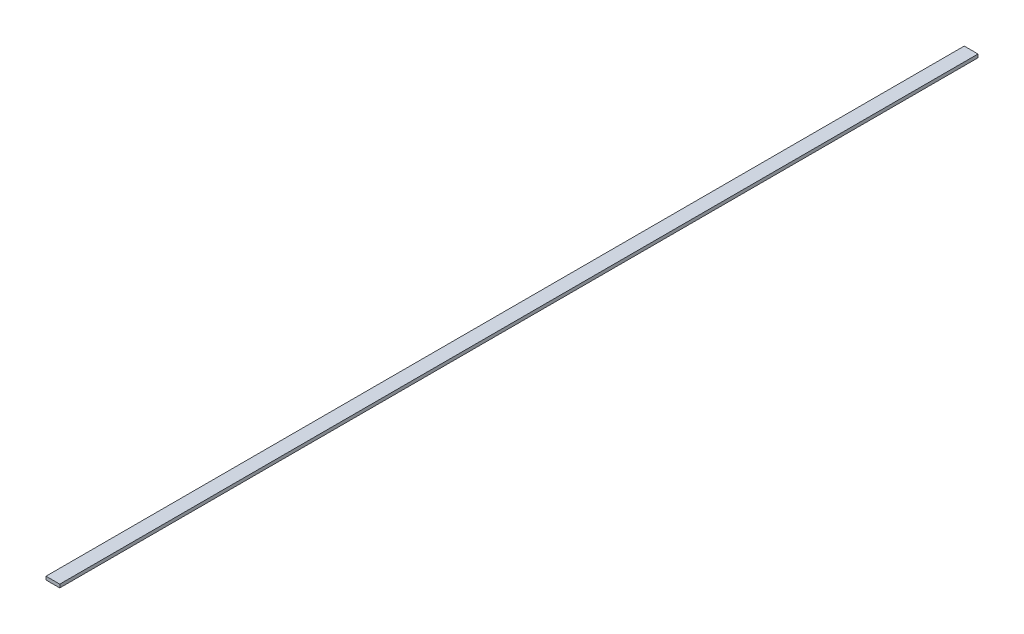
ISO-10303-21;
HEADER;
FILE_DESCRIPTION(('STEP AP214'),'2;1');
FILE_NAME('part.step','',(''),(''),'','','');
FILE_SCHEMA(('AUTOMOTIVE_DESIGN { 1 0 10303 214 1 1 1 1 }'));
ENDSEC;
DATA;
#1=APPLICATION_CONTEXT('core data for automotive mechanical design processes');
#2=APPLICATION_PROTOCOL_DEFINITION('international standard','automotive_design',2000,#1);
#3=PRODUCT_CONTEXT('',#1,'mechanical');
#4=PRODUCT('Part','Part','',(#3));
#5=PRODUCT_RELATED_PRODUCT_CATEGORY('part','',(#4));
#6=PRODUCT_DEFINITION_FORMATION('','',#4);
#7=PRODUCT_DEFINITION_CONTEXT('part definition',#1,'design');
#8=PRODUCT_DEFINITION('design','',#6,#7);
#9=PRODUCT_DEFINITION_SHAPE('','',#8);
#10=(LENGTH_UNIT() NAMED_UNIT(*) SI_UNIT(.MILLI.,.METRE.));
#11=(NAMED_UNIT(*) PLANE_ANGLE_UNIT() SI_UNIT($,.RADIAN.));
#12=(NAMED_UNIT(*) SI_UNIT($,.STERADIAN.) SOLID_ANGLE_UNIT());
#13=UNCERTAINTY_MEASURE_WITH_UNIT(LENGTH_MEASURE(1.E-05),#10,'distance_accuracy_value','');
#14=(GEOMETRIC_REPRESENTATION_CONTEXT(3) GLOBAL_UNCERTAINTY_ASSIGNED_CONTEXT((#13)) GLOBAL_UNIT_ASSIGNED_CONTEXT((#10,
#11,#12)) REPRESENTATION_CONTEXT('',''));
#15=CARTESIAN_POINT('',(0.,0.,0.));
#16=DIRECTION('',(0.,0.,1.));
#17=DIRECTION('',(1.,0.,0.));
#18=AXIS2_PLACEMENT_3D('',#15,#16,#17);
#19=CARTESIAN_POINT('',(0.,1.5,0.));
#20=DIRECTION('',(1.,0.,0.));
#21=DIRECTION('',(0.,0.,-1.));
#22=AXIS2_PLACEMENT_3D('',#19,#20,#21);
#23=PLANE('',#22);
#24=DIRECTION('',(0.,0.,1.));
#25=VECTOR('',#24,1.);
#26=CARTESIAN_POINT('',(0.,0.,0.));
#27=LINE('',#26,#25);
#28=CARTESIAN_POINT('',(0.,0.,-414.));
#29=VERTEX_POINT('',#28);
#30=CARTESIAN_POINT('',(0.,0.,0.));
#31=VERTEX_POINT('',#30);
#32=EDGE_CURVE('E111',#29,#31,#27,.T.);
#33=ORIENTED_EDGE('',*,*,#32,.T.);
#34=DIRECTION('',(0.,-1.,0.));
#35=VECTOR('',#34,1.);
#36=CARTESIAN_POINT('',(0.,1.5,0.));
#37=LINE('',#36,#35);
#38=CARTESIAN_POINT('',(0.,1.5,0.));
#39=VERTEX_POINT('',#38);
#40=EDGE_CURVE('E11',#39,#31,#37,.T.);
#41=ORIENTED_EDGE('',*,*,#40,.F.);
#42=DIRECTION('',(0.,0.,1.));
#43=VECTOR('',#42,1.);
#44=CARTESIAN_POINT('',(0.,1.5,0.));
#45=LINE('',#44,#43);
#46=CARTESIAN_POINT('',(0.,1.5,-414.));
#47=VERTEX_POINT('',#46);
#48=EDGE_CURVE('E94',#47,#39,#45,.T.);
#49=ORIENTED_EDGE('',*,*,#48,.F.);
#50=DIRECTION('',(0.,-1.,0.));
#51=VECTOR('',#50,1.);
#52=CARTESIAN_POINT('',(0.,1.5,-414.));
#53=LINE('',#52,#51);
#54=EDGE_CURVE('E107',#47,#29,#53,.T.);
#55=ORIENTED_EDGE('',*,*,#54,.T.);
#56=EDGE_LOOP('',(#33,#41,#49,#55));
#57=FACE_BOUND('',#56,.T.);
#58=ADVANCED_FACE('F38',(#57),#23,.F.);
#59=CARTESIAN_POINT('',(0.,1.5,0.));
#60=DIRECTION('',(0.,0.,-1.));
#61=DIRECTION('',(-1.,0.,0.));
#62=AXIS2_PLACEMENT_3D('',#59,#60,#61);
#63=PLANE('',#62);
#64=DIRECTION('',(1.,0.,0.));
#65=VECTOR('',#64,1.);
#66=CARTESIAN_POINT('',(0.,0.,0.));
#67=LINE('',#66,#65);
#68=CARTESIAN_POINT('',(6.2,0.,0.));
#69=VERTEX_POINT('',#68);
#70=EDGE_CURVE('E99',#31,#69,#67,.T.);
#71=ORIENTED_EDGE('',*,*,#70,.T.);
#72=DIRECTION('',(0.,-1.,0.));
#73=VECTOR('',#72,1.);
#74=CARTESIAN_POINT('',(6.2,1.5,0.));
#75=LINE('',#74,#73);
#76=CARTESIAN_POINT('',(6.2,1.5,0.));
#77=VERTEX_POINT('',#76);
#78=EDGE_CURVE('E47',#77,#69,#75,.T.);
#79=ORIENTED_EDGE('',*,*,#78,.F.);
#80=DIRECTION('',(1.,0.,0.));
#81=VECTOR('',#80,1.);
#82=CARTESIAN_POINT('',(0.,1.5,0.));
#83=LINE('',#82,#81);
#84=EDGE_CURVE('E89',#39,#77,#83,.T.);
#85=ORIENTED_EDGE('',*,*,#84,.F.);
#86=ORIENTED_EDGE('',*,*,#40,.T.);
#87=EDGE_LOOP('',(#71,#79,#85,#86));
#88=FACE_BOUND('',#87,.T.);
#89=ADVANCED_FACE('F98',(#88),#63,.F.);
#90=CARTESIAN_POINT('',(6.2,1.5,0.));
#91=DIRECTION('',(-1.,0.,0.));
#92=DIRECTION('',(0.,0.,1.));
#93=AXIS2_PLACEMENT_3D('',#90,#91,#92);
#94=PLANE('',#93);
#95=DIRECTION('',(0.,0.,-1.));
#96=VECTOR('',#95,1.);
#97=CARTESIAN_POINT('',(6.2,0.,0.));
#98=LINE('',#97,#96);
#99=CARTESIAN_POINT('',(6.2,0.,-414.));
#100=VERTEX_POINT('',#99);
#101=EDGE_CURVE('E74',#69,#100,#98,.T.);
#102=ORIENTED_EDGE('',*,*,#101,.T.);
#103=DIRECTION('',(0.,-1.,0.));
#104=VECTOR('',#103,1.);
#105=CARTESIAN_POINT('',(6.2,1.5,-414.));
#106=LINE('',#105,#104);
#107=CARTESIAN_POINT('',(6.2,1.5,-414.));
#108=VERTEX_POINT('',#107);
#109=EDGE_CURVE('E101',#108,#100,#106,.T.);
#110=ORIENTED_EDGE('',*,*,#109,.F.);
#111=DIRECTION('',(0.,0.,-1.));
#112=VECTOR('',#111,1.);
#113=CARTESIAN_POINT('',(6.2,1.5,0.));
#114=LINE('',#113,#112);
#115=EDGE_CURVE('E92',#77,#108,#114,.T.);
#116=ORIENTED_EDGE('',*,*,#115,.F.);
#117=ORIENTED_EDGE('',*,*,#78,.T.);
#118=EDGE_LOOP('',(#102,#110,#116,#117));
#119=FACE_BOUND('',#118,.T.);
#120=ADVANCED_FACE('F102',(#119),#94,.F.);
#121=CARTESIAN_POINT('',(0.,1.5,-414.));
#122=DIRECTION('',(0.,0.,1.));
#123=DIRECTION('',(1.,0.,0.));
#124=AXIS2_PLACEMENT_3D('',#121,#122,#123);
#125=PLANE('',#124);
#126=DIRECTION('',(-1.,0.,0.));
#127=VECTOR('',#126,1.);
#128=CARTESIAN_POINT('',(0.,0.,-414.));
#129=LINE('',#128,#127);
#130=EDGE_CURVE('E80',#100,#29,#129,.T.);
#131=ORIENTED_EDGE('',*,*,#130,.T.);
#132=ORIENTED_EDGE('',*,*,#54,.F.);
#133=DIRECTION('',(-1.,0.,0.));
#134=VECTOR('',#133,1.);
#135=CARTESIAN_POINT('',(0.,1.5,-414.));
#136=LINE('',#135,#134);
#137=EDGE_CURVE('E55',#108,#47,#136,.T.);
#138=ORIENTED_EDGE('',*,*,#137,.F.);
#139=ORIENTED_EDGE('',*,*,#109,.T.);
#140=EDGE_LOOP('',(#131,#132,#138,#139));
#141=FACE_BOUND('',#140,.T.);
#142=ADVANCED_FACE('F120',(#141),#125,.F.);
#143=CARTESIAN_POINT('',(0.,1.5,0.));
#144=DIRECTION('',(0.,-1.,0.));
#145=DIRECTION('',(0.,0.,-1.));
#146=AXIS2_PLACEMENT_3D('',#143,#144,#145);
#147=PLANE('',#146);
#148=ORIENTED_EDGE('',*,*,#48,.T.);
#149=ORIENTED_EDGE('',*,*,#84,.T.);
#150=ORIENTED_EDGE('',*,*,#115,.T.);
#151=ORIENTED_EDGE('',*,*,#137,.T.);
#152=EDGE_LOOP('',(#148,#149,#150,#151));
#153=FACE_BOUND('',#152,.T.);
#154=ADVANCED_FACE('F90',(#153),#147,.F.);
#155=CARTESIAN_POINT('',(0.,0.,0.));
#156=DIRECTION('',(0.,-1.,0.));
#157=DIRECTION('',(0.,0.,-1.));
#158=AXIS2_PLACEMENT_3D('',#155,#156,#157);
#159=PLANE('',#158);
#160=ORIENTED_EDGE('',*,*,#32,.F.);
#161=ORIENTED_EDGE('',*,*,#130,.F.);
#162=ORIENTED_EDGE('',*,*,#101,.F.);
#163=ORIENTED_EDGE('',*,*,#70,.F.);
#164=EDGE_LOOP('',(#160,#161,#162,#163));
#165=FACE_BOUND('',#164,.T.);
#166=ADVANCED_FACE('F123',(#165),#159,.T.);
#167=CLOSED_SHELL('',(#58,#89,#120,#142,#154,#166));
#168=MANIFOLD_SOLID_BREP('B2',#167);
#169=ADVANCED_BREP_SHAPE_REPRESENTATION('',(#18,#168),#14);
#170=SHAPE_DEFINITION_REPRESENTATION(#9,#169);
ENDSEC;
END-ISO-10303-21;
